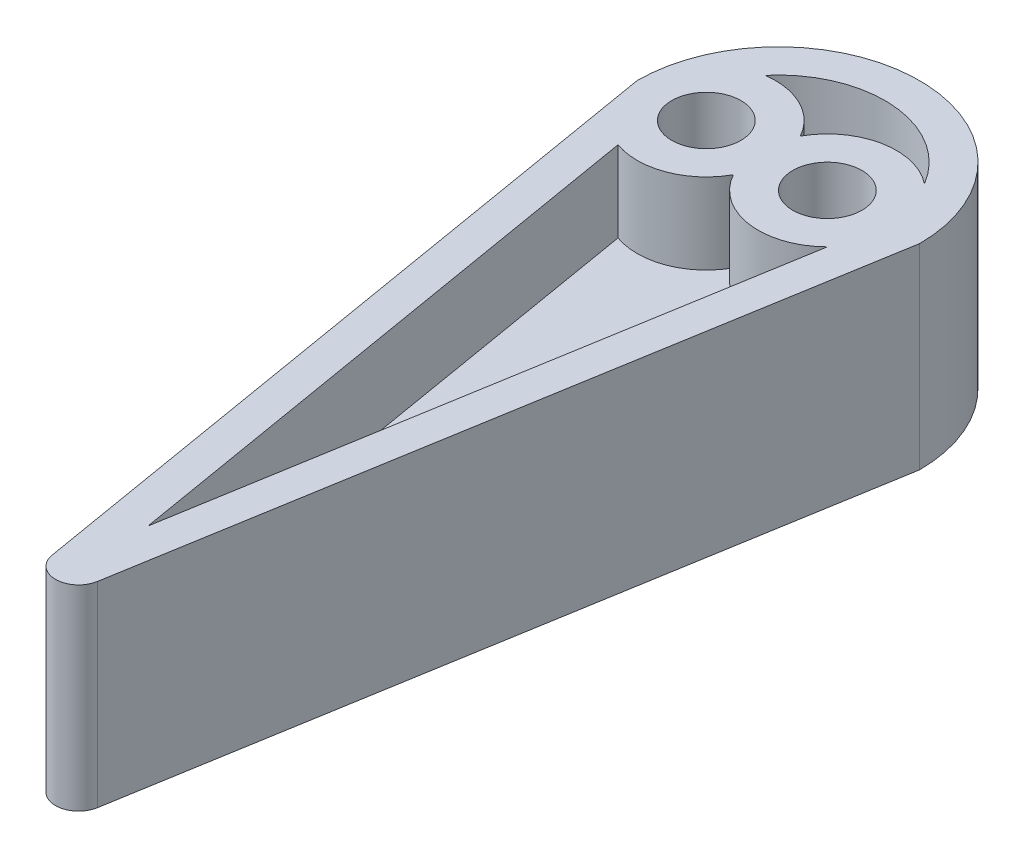
ISO-10303-21;
HEADER;
FILE_DESCRIPTION(('STEP AP214'),'2;1');
FILE_NAME('part.step','',(''),(''),'','','');
FILE_SCHEMA(('AUTOMOTIVE_DESIGN { 1 0 10303 214 1 1 1 1 }'));
ENDSEC;
DATA;
#1=APPLICATION_CONTEXT('core data for automotive mechanical design processes');
#2=APPLICATION_PROTOCOL_DEFINITION('international standard','automotive_design',2000,#1);
#3=PRODUCT_CONTEXT('',#1,'mechanical');
#4=PRODUCT('Part','Part','',(#3));
#5=PRODUCT_RELATED_PRODUCT_CATEGORY('part','',(#4));
#6=PRODUCT_DEFINITION_FORMATION('','',#4);
#7=PRODUCT_DEFINITION_CONTEXT('part definition',#1,'design');
#8=PRODUCT_DEFINITION('design','',#6,#7);
#9=PRODUCT_DEFINITION_SHAPE('','',#8);
#10=(LENGTH_UNIT() NAMED_UNIT(*) SI_UNIT(.MILLI.,.METRE.));
#11=(NAMED_UNIT(*) PLANE_ANGLE_UNIT() SI_UNIT($,.RADIAN.));
#12=(NAMED_UNIT(*) SI_UNIT($,.STERADIAN.) SOLID_ANGLE_UNIT());
#13=UNCERTAINTY_MEASURE_WITH_UNIT(LENGTH_MEASURE(1.E-05),#10,'distance_accuracy_value','');
#14=(GEOMETRIC_REPRESENTATION_CONTEXT(3) GLOBAL_UNCERTAINTY_ASSIGNED_CONTEXT((#13)) GLOBAL_UNIT_ASSIGNED_CONTEXT((#10,
#11,#12)) REPRESENTATION_CONTEXT('',''));
#15=CARTESIAN_POINT('',(0.,0.,0.));
#16=DIRECTION('',(0.,0.,1.));
#17=DIRECTION('',(1.,0.,0.));
#18=AXIS2_PLACEMENT_3D('',#15,#16,#17);
#19=CARTESIAN_POINT('',(0.,8.5,0.));
#20=DIRECTION('',(0.,-1.,0.));
#21=DIRECTION('',(0.,0.,-1.));
#22=AXIS2_PLACEMENT_3D('',#19,#20,#21);
#23=CYLINDRICAL_SURFACE('',#22,12.25);
#24=DIRECTION('',(0.,-1.,0.));
#25=VECTOR('',#24,1.);
#26=CARTESIAN_POINT('',(12.25,8.5,0.));
#27=LINE('',#26,#25);
#28=CARTESIAN_POINT('',(12.25,8.5,0.));
#29=VERTEX_POINT('',#28);
#30=CARTESIAN_POINT('',(12.25,-8.5,0.));
#31=VERTEX_POINT('',#30);
#32=EDGE_CURVE('E294',#29,#31,#27,.T.);
#33=ORIENTED_EDGE('',*,*,#32,.T.);
#34=CARTESIAN_POINT('',(0.,-8.5,0.));
#35=DIRECTION('',(0.,-1.,0.));
#36=DIRECTION('',(0.,0.,-1.));
#37=AXIS2_PLACEMENT_3D('',#34,#35,#36);
#38=CIRCLE('',#37,12.25);
#39=CARTESIAN_POINT('',(-12.25,-8.5,0.));
#40=VERTEX_POINT('',#39);
#41=EDGE_CURVE('E223',#40,#31,#38,.T.);
#42=ORIENTED_EDGE('',*,*,#41,.F.);
#43=DIRECTION('',(0.,-1.,0.));
#44=VECTOR('',#43,1.);
#45=CARTESIAN_POINT('',(-12.25,8.5,0.));
#46=LINE('',#45,#44);
#47=CARTESIAN_POINT('',(-12.25,8.5,0.));
#48=VERTEX_POINT('',#47);
#49=EDGE_CURVE('E295',#48,#40,#46,.T.);
#50=ORIENTED_EDGE('',*,*,#49,.F.);
#51=CARTESIAN_POINT('',(0.,8.5,0.));
#52=DIRECTION('',(0.,-1.,0.));
#53=DIRECTION('',(0.,0.,-1.));
#54=AXIS2_PLACEMENT_3D('',#51,#52,#53);
#55=CIRCLE('',#54,12.25);
#56=EDGE_CURVE('E285',#48,#29,#55,.T.);
#57=ORIENTED_EDGE('',*,*,#56,.T.);
#58=EDGE_LOOP('',(#33,#42,#50,#57));
#59=FACE_BOUND('',#58,.T.);
#60=ADVANCED_FACE('F35',(#59),#23,.T.);
#61=CARTESIAN_POINT('',(-12.25,8.5,0.));
#62=DIRECTION('',(0.986117785045644,0.,-0.166047324629679));
#63=DIRECTION('',(-0.166047324629679,0.,-0.986117785045644));
#64=AXIS2_PLACEMENT_3D('',#61,#62,#63);
#65=PLANE('',#64);
#66=ORIENTED_EDGE('',*,*,#49,.T.);
#67=DIRECTION('',(0.166047324629679,0.,0.986117785045644));
#68=VECTOR('',#67,1.);
#69=CARTESIAN_POINT('',(-12.25,-8.5,0.));
#70=LINE('',#69,#68);
#71=CARTESIAN_POINT('',(-1.97223557009129,-8.5,61.0373356959885));
#72=VERTEX_POINT('',#71);
#73=EDGE_CURVE('E229',#40,#72,#70,.T.);
#74=ORIENTED_EDGE('',*,*,#73,.T.);
#75=DIRECTION('',(0.,-1.,0.));
#76=VECTOR('',#75,1.);
#77=CARTESIAN_POINT('',(-1.97223557009129,8.5,61.0373356959885));
#78=LINE('',#77,#76);
#79=CARTESIAN_POINT('',(-1.97223557009129,8.5,61.0373356959885));
#80=VERTEX_POINT('',#79);
#81=EDGE_CURVE('E43',#72,#80,#78,.F.);
#82=ORIENTED_EDGE('',*,*,#81,.T.);
#83=DIRECTION('',(0.166047324629679,0.,0.986117785045644));
#84=VECTOR('',#83,1.);
#85=CARTESIAN_POINT('',(-12.25,8.5,0.));
#86=LINE('',#85,#84);
#87=EDGE_CURVE('E291',#48,#80,#86,.T.);
#88=ORIENTED_EDGE('',*,*,#87,.F.);
#89=EDGE_LOOP('',(#66,#74,#82,#88));
#90=FACE_BOUND('',#89,.T.);
#91=ADVANCED_FACE('F301',(#90),#65,.F.);
#92=CARTESIAN_POINT('',(12.25,8.5,0.));
#93=DIRECTION('',(0.986117785045644,0.,0.166047324629679));
#94=DIRECTION('',(0.166047324629679,0.,-0.986117785045644));
#95=AXIS2_PLACEMENT_3D('',#92,#93,#94);
#96=PLANE('',#95);
#97=DIRECTION('',(-0.166047324629679,0.,0.986117785045644));
#98=VECTOR('',#97,1.);
#99=CARTESIAN_POINT('',(12.25,8.5,0.));
#100=LINE('',#99,#98);
#101=CARTESIAN_POINT('',(1.97223557009129,8.5,61.0373356959885));
#102=VERTEX_POINT('',#101);
#103=EDGE_CURVE('E288',#29,#102,#100,.T.);
#104=ORIENTED_EDGE('',*,*,#103,.T.);
#105=DIRECTION('',(0.,-1.,0.));
#106=VECTOR('',#105,1.);
#107=CARTESIAN_POINT('',(1.97223557009129,0.,61.0373356959885));
#108=LINE('',#107,#106);
#109=CARTESIAN_POINT('',(1.97223557009129,-8.5,61.0373356959885));
#110=VERTEX_POINT('',#109);
#111=EDGE_CURVE('E297',#102,#110,#108,.T.);
#112=ORIENTED_EDGE('',*,*,#111,.T.);
#113=DIRECTION('',(-0.166047324629679,0.,0.986117785045644));
#114=VECTOR('',#113,1.);
#115=CARTESIAN_POINT('',(12.25,-8.5,0.));
#116=LINE('',#115,#114);
#117=EDGE_CURVE('E226',#31,#110,#116,.T.);
#118=ORIENTED_EDGE('',*,*,#117,.F.);
#119=ORIENTED_EDGE('',*,*,#32,.F.);
#120=EDGE_LOOP('',(#104,#112,#118,#119));
#121=FACE_BOUND('',#120,.T.);
#122=ADVANCED_FACE('F313',(#121),#96,.T.);
#123=CARTESIAN_POINT('',(0.,8.5,0.));
#124=DIRECTION('',(0.,-1.,0.));
#125=DIRECTION('',(0.,0.,-1.));
#126=AXIS2_PLACEMENT_3D('',#123,#124,#125);
#127=PLANE('',#126);
#128=CARTESIAN_POINT('',(4.25,8.5,0.));
#129=DIRECTION('',(0.,-1.,0.));
#130=DIRECTION('',(0.,0.,-1.));
#131=AXIS2_PLACEMENT_3D('',#128,#129,#130);
#132=CIRCLE('',#131,6.);
#133=CARTESIAN_POINT('',(-0.999999999999999,8.5,2.90473750965557));
#134=VERTEX_POINT('',#133);
#135=CARTESIAN_POINT('',(8.49351834088833,8.5,4.24176285175684));
#136=VERTEX_POINT('',#135);
#137=EDGE_CURVE('E267',#134,#136,#132,.F.);
#138=ORIENTED_EDGE('',*,*,#137,.T.);
#139=DIRECTION('',(-0.166047324629679,0.,0.986117785045644));
#140=VECTOR('',#139,1.);
#141=CARTESIAN_POINT('',(8.95389314815881,8.5,1.50770022082399));
#142=LINE('',#141,#140);
#143=CARTESIAN_POINT('',(0.,8.5,54.6828615700937));
#144=VERTEX_POINT('',#143);
#145=EDGE_CURVE('E260',#136,#144,#142,.T.);
#146=ORIENTED_EDGE('',*,*,#145,.T.);
#147=DIRECTION('',(0.166047324629679,0.,0.986117785045644));
#148=VECTOR('',#147,1.);
#149=CARTESIAN_POINT('',(-8.95389314815881,8.5,1.50770022082399));
#150=LINE('',#149,#148);
#151=CARTESIAN_POINT('',(-8.2555704943141,8.5,5.65488169569769));
#152=VERTEX_POINT('',#151);
#153=EDGE_CURVE('E248',#152,#144,#150,.T.);
#154=ORIENTED_EDGE('',*,*,#153,.F.);
#155=CARTESIAN_POINT('',(-6.25,8.5,0.));
#156=DIRECTION('',(0.,-1.,0.));
#157=DIRECTION('',(0.,0.,-1.));
#158=AXIS2_PLACEMENT_3D('',#155,#156,#157);
#159=CIRCLE('',#158,6.);
#160=EDGE_CURVE('E50',#152,#134,#159,.F.);
#161=ORIENTED_EDGE('',*,*,#160,.T.);
#162=EDGE_LOOP('',(#138,#146,#154,#161));
#163=FACE_BOUND('',#162,.T.);
#164=CARTESIAN_POINT('',(7.95588235294118,8.5,-4.71873245545445));
#165=VERTEX_POINT('',#164);
#166=CARTESIAN_POINT('',(-1.,8.5,-2.90473750965556));
#167=VERTEX_POINT('',#166);
#168=EDGE_CURVE('E58',#165,#167,#132,.F.);
#169=ORIENTED_EDGE('',*,*,#168,.T.);
#170=CARTESIAN_POINT('',(-7.09,8.5,-5.94090902135355));
#171=VERTEX_POINT('',#170);
#172=EDGE_CURVE('E257',#167,#171,#159,.F.);
#173=ORIENTED_EDGE('',*,*,#172,.T.);
#174=CARTESIAN_POINT('',(0.,8.5,0.));
#175=DIRECTION('',(0.,-1.,0.));
#176=DIRECTION('',(0.,0.,-1.));
#177=AXIS2_PLACEMENT_3D('',#174,#175,#176);
#178=CIRCLE('',#177,9.25);
#179=EDGE_CURVE('E243',#171,#165,#178,.T.);
#180=ORIENTED_EDGE('',*,*,#179,.T.);
#181=EDGE_LOOP('',(#169,#173,#180));
#182=FACE_BOUND('',#181,.T.);
#183=CARTESIAN_POINT('',(4.25,8.5,0.));
#184=DIRECTION('',(0.,1.,0.));
#185=DIRECTION('',(0.,0.,1.));
#186=AXIS2_PLACEMENT_3D('',#183,#184,#185);
#187=CIRCLE('',#186,3.);
#188=CARTESIAN_POINT('',(4.25,8.5,3.));
#189=VERTEX_POINT('',#188);
#190=EDGE_CURVE('E279',#189,#189,#187,.T.);
#191=ORIENTED_EDGE('',*,*,#190,.F.);
#192=EDGE_LOOP('',(#191));
#193=FACE_BOUND('',#192,.T.);
#194=CARTESIAN_POINT('',(-6.25,8.5,0.));
#195=DIRECTION('',(0.,1.,0.));
#196=DIRECTION('',(0.,0.,1.));
#197=AXIS2_PLACEMENT_3D('',#194,#195,#196);
#198=CIRCLE('',#197,3.);
#199=CARTESIAN_POINT('',(-6.25,8.5,3.00000000000001));
#200=VERTEX_POINT('',#199);
#201=EDGE_CURVE('E282',#200,#200,#198,.T.);
#202=ORIENTED_EDGE('',*,*,#201,.F.);
#203=EDGE_LOOP('',(#202));
#204=FACE_BOUND('',#203,.T.);
#205=ORIENTED_EDGE('',*,*,#87,.T.);
#206=CARTESIAN_POINT('',(0.,8.5,60.7052410467291));
#207=DIRECTION('',(0.,-1.,0.));
#208=DIRECTION('',(0.,0.,-1.));
#209=AXIS2_PLACEMENT_3D('',#206,#207,#208);
#210=CIRCLE('',#209,2.);
#211=EDGE_CURVE('E11',#80,#102,#210,.F.);
#212=ORIENTED_EDGE('',*,*,#211,.T.);
#213=ORIENTED_EDGE('',*,*,#103,.F.);
#214=ORIENTED_EDGE('',*,*,#56,.F.);
#215=EDGE_LOOP('',(#205,#212,#213,#214));
#216=FACE_BOUND('',#215,.T.);
#217=ADVANCED_FACE('F308',(#163,#182,#193,#204,#216),#127,.F.);
#218=CARTESIAN_POINT('',(0.,8.5,60.7052410467291));
#219=DIRECTION('',(0.,1.,0.));
#220=DIRECTION('',(0.,0.,1.));
#221=AXIS2_PLACEMENT_3D('',#218,#219,#220);
#222=CYLINDRICAL_SURFACE('',#221,2.);
#223=ORIENTED_EDGE('',*,*,#211,.F.);
#224=ORIENTED_EDGE('',*,*,#81,.F.);
#225=CARTESIAN_POINT('',(0.,-8.5,60.7052410467291));
#226=DIRECTION('',(0.,-1.,0.));
#227=DIRECTION('',(0.,0.,-1.));
#228=AXIS2_PLACEMENT_3D('',#225,#226,#227);
#229=CIRCLE('',#228,2.);
#230=EDGE_CURVE('E232',#72,#110,#229,.F.);
#231=ORIENTED_EDGE('',*,*,#230,.T.);
#232=ORIENTED_EDGE('',*,*,#111,.F.);
#233=EDGE_LOOP('',(#223,#224,#231,#232));
#234=FACE_BOUND('',#233,.T.);
#235=ADVANCED_FACE('F37',(#234),#222,.T.);
#236=CARTESIAN_POINT('',(-6.25,0.,0.));
#237=DIRECTION('',(0.,1.,0.));
#238=DIRECTION('',(0.,0.,1.));
#239=AXIS2_PLACEMENT_3D('',#236,#237,#238);
#240=CYLINDRICAL_SURFACE('',#239,3.);
#241=ORIENTED_EDGE('',*,*,#201,.T.);
#242=EDGE_LOOP('',(#241));
#243=FACE_BOUND('',#242,.T.);
#244=CARTESIAN_POINT('',(-6.25,-8.5,0.));
#245=DIRECTION('',(0.,1.,0.));
#246=DIRECTION('',(0.,0.,1.));
#247=AXIS2_PLACEMENT_3D('',#244,#245,#246);
#248=CIRCLE('',#247,3.);
#249=CARTESIAN_POINT('',(-6.25,-8.5,3.00000000000001));
#250=VERTEX_POINT('',#249);
#251=EDGE_CURVE('E220',#250,#250,#248,.T.);
#252=ORIENTED_EDGE('',*,*,#251,.F.);
#253=EDGE_LOOP('',(#252));
#254=FACE_BOUND('',#253,.T.);
#255=ADVANCED_FACE('F349',(#243,#254),#240,.F.);
#256=CARTESIAN_POINT('',(4.25,0.,0.));
#257=DIRECTION('',(0.,1.,0.));
#258=DIRECTION('',(0.,0.,1.));
#259=AXIS2_PLACEMENT_3D('',#256,#257,#258);
#260=CYLINDRICAL_SURFACE('',#259,3.);
#261=ORIENTED_EDGE('',*,*,#190,.T.);
#262=EDGE_LOOP('',(#261));
#263=FACE_BOUND('',#262,.T.);
#264=CARTESIAN_POINT('',(4.25,-8.5,0.));
#265=DIRECTION('',(0.,1.,0.));
#266=DIRECTION('',(0.,0.,1.));
#267=AXIS2_PLACEMENT_3D('',#264,#265,#266);
#268=CIRCLE('',#267,3.);
#269=CARTESIAN_POINT('',(4.25,-8.5,3.));
#270=VERTEX_POINT('',#269);
#271=EDGE_CURVE('E217',#270,#270,#268,.T.);
#272=ORIENTED_EDGE('',*,*,#271,.F.);
#273=EDGE_LOOP('',(#272));
#274=FACE_BOUND('',#273,.T.);
#275=ADVANCED_FACE('F352',(#263,#274),#260,.F.);
#276=CARTESIAN_POINT('',(0.,8.5,0.));
#277=DIRECTION('',(0.,-1.,0.));
#278=DIRECTION('',(0.,0.,-1.));
#279=AXIS2_PLACEMENT_3D('',#276,#277,#278);
#280=CYLINDRICAL_SURFACE('',#279,9.25);
#281=CARTESIAN_POINT('',(0.,1.5,0.));
#282=DIRECTION('',(0.,-1.,0.));
#283=DIRECTION('',(0.,0.,-1.));
#284=AXIS2_PLACEMENT_3D('',#281,#282,#283);
#285=CIRCLE('',#284,9.25);
#286=CARTESIAN_POINT('',(-7.09,1.5,-5.94090902135355));
#287=VERTEX_POINT('',#286);
#288=CARTESIAN_POINT('',(7.95588235294118,1.5,-4.71873245545445));
#289=VERTEX_POINT('',#288);
#290=EDGE_CURVE('E235',#287,#289,#285,.T.);
#291=ORIENTED_EDGE('',*,*,#290,.T.);
#292=DIRECTION('',(0.,1.,0.));
#293=VECTOR('',#292,1.);
#294=CARTESIAN_POINT('',(7.95588235294118,0.,-4.71873245545445));
#295=LINE('',#294,#293);
#296=EDGE_CURVE('E273',#289,#165,#295,.T.);
#297=ORIENTED_EDGE('',*,*,#296,.T.);
#298=ORIENTED_EDGE('',*,*,#179,.F.);
#299=DIRECTION('',(0.,1.,0.));
#300=VECTOR('',#299,1.);
#301=CARTESIAN_POINT('',(-7.09,8.5,-5.94090902135355));
#302=LINE('',#301,#300);
#303=EDGE_CURVE('E277',#287,#171,#302,.T.);
#304=ORIENTED_EDGE('',*,*,#303,.F.);
#305=EDGE_LOOP('',(#291,#297,#298,#304));
#306=FACE_BOUND('',#305,.T.);
#307=ADVANCED_FACE('F355',(#306),#280,.F.);
#308=CARTESIAN_POINT('',(0.,1.5,0.));
#309=DIRECTION('',(0.,-1.,0.));
#310=DIRECTION('',(0.,0.,-1.));
#311=AXIS2_PLACEMENT_3D('',#308,#309,#310);
#312=PLANE('',#311);
#313=CARTESIAN_POINT('',(4.25,1.5,0.));
#314=DIRECTION('',(0.,-1.,0.));
#315=DIRECTION('',(0.,0.,-1.));
#316=AXIS2_PLACEMENT_3D('',#313,#314,#315);
#317=CIRCLE('',#316,6.);
#318=CARTESIAN_POINT('',(-1.,1.5,-2.90473750965556));
#319=VERTEX_POINT('',#318);
#320=EDGE_CURVE('E250',#289,#319,#317,.F.);
#321=ORIENTED_EDGE('',*,*,#320,.F.);
#322=ORIENTED_EDGE('',*,*,#290,.F.);
#323=CARTESIAN_POINT('',(-6.25,1.5,0.));
#324=DIRECTION('',(0.,-1.,0.));
#325=DIRECTION('',(0.,0.,-1.));
#326=AXIS2_PLACEMENT_3D('',#323,#324,#325);
#327=CIRCLE('',#326,6.);
#328=EDGE_CURVE('E254',#319,#287,#327,.F.);
#329=ORIENTED_EDGE('',*,*,#328,.F.);
#330=EDGE_LOOP('',(#321,#322,#329));
#331=FACE_BOUND('',#330,.T.);
#332=ADVANCED_FACE('F366',(#331),#312,.F.);
#333=CARTESIAN_POINT('',(4.25,0.,0.));
#334=DIRECTION('',(0.,1.,0.));
#335=DIRECTION('',(0.,0.,1.));
#336=AXIS2_PLACEMENT_3D('',#333,#334,#335);
#337=CYLINDRICAL_SURFACE('',#336,6.);
#338=ORIENTED_EDGE('',*,*,#320,.T.);
#339=DIRECTION('',(0.,-1.,0.));
#340=VECTOR('',#339,1.);
#341=CARTESIAN_POINT('',(-1.,0.,-2.90473750965556));
#342=LINE('',#341,#340);
#343=EDGE_CURVE('E247',#167,#319,#342,.T.);
#344=ORIENTED_EDGE('',*,*,#343,.F.);
#345=ORIENTED_EDGE('',*,*,#168,.F.);
#346=ORIENTED_EDGE('',*,*,#296,.F.);
#347=EDGE_LOOP('',(#338,#344,#345,#346));
#348=FACE_BOUND('',#347,.T.);
#349=ADVANCED_FACE('F333',(#348),#337,.T.);
#350=CARTESIAN_POINT('',(-6.25,0.,0.));
#351=DIRECTION('',(0.,1.,0.));
#352=DIRECTION('',(0.,0.,1.));
#353=AXIS2_PLACEMENT_3D('',#350,#351,#352);
#354=CYLINDRICAL_SURFACE('',#353,6.);
#355=ORIENTED_EDGE('',*,*,#303,.T.);
#356=ORIENTED_EDGE('',*,*,#172,.F.);
#357=ORIENTED_EDGE('',*,*,#343,.T.);
#358=ORIENTED_EDGE('',*,*,#328,.T.);
#359=EDGE_LOOP('',(#355,#356,#357,#358));
#360=FACE_BOUND('',#359,.T.);
#361=ADVANCED_FACE('F361',(#360),#354,.T.);
#362=CARTESIAN_POINT('',(-9.29164664486307,8.5,-0.498141973889034));
#363=DIRECTION('',(0.986117785045644,0.,-0.166047324629679));
#364=DIRECTION('',(-0.166047324629679,0.,-0.986117785045644));
#365=AXIS2_PLACEMENT_3D('',#362,#363,#364);
#366=PLANE('',#365);
#367=ORIENTED_EDGE('',*,*,#153,.T.);
#368=DIRECTION('',(0.,1.,0.));
#369=VECTOR('',#368,1.);
#370=CARTESIAN_POINT('',(0.,8.5,54.6828615700937));
#371=LINE('',#370,#369);
#372=CARTESIAN_POINT('',(0.,1.5,54.6828615700937));
#373=VERTEX_POINT('',#372);
#374=EDGE_CURVE('E244',#373,#144,#371,.T.);
#375=ORIENTED_EDGE('',*,*,#374,.F.);
#376=DIRECTION('',(0.166047324629679,0.,0.986117785045644));
#377=VECTOR('',#376,1.);
#378=CARTESIAN_POINT('',(-8.95389314815881,1.5,1.50770022082399));
#379=LINE('',#378,#377);
#380=CARTESIAN_POINT('',(-8.2555704943141,1.5,5.65488169569769));
#381=VERTEX_POINT('',#380);
#382=EDGE_CURVE('E240',#381,#373,#379,.T.);
#383=ORIENTED_EDGE('',*,*,#382,.F.);
#384=DIRECTION('',(0.,1.,0.));
#385=VECTOR('',#384,1.);
#386=CARTESIAN_POINT('',(-8.2555704943141,0.,5.65488169569769));
#387=LINE('',#386,#385);
#388=EDGE_CURVE('E275',#152,#381,#387,.F.);
#389=ORIENTED_EDGE('',*,*,#388,.F.);
#390=EDGE_LOOP('',(#367,#375,#383,#389));
#391=FACE_BOUND('',#390,.T.);
#392=ADVANCED_FACE('F369',(#391),#366,.T.);
#393=CARTESIAN_POINT('',(9.29164664486307,8.5,-0.498141973889035));
#394=DIRECTION('',(0.986117785045644,0.,0.166047324629679));
#395=DIRECTION('',(0.166047324629679,0.,-0.986117785045644));
#396=AXIS2_PLACEMENT_3D('',#393,#394,#395);
#397=PLANE('',#396);
#398=DIRECTION('',(-0.166047324629679,0.,0.986117785045644));
#399=VECTOR('',#398,1.);
#400=CARTESIAN_POINT('',(8.95389314815881,1.5,1.50770022082399));
#401=LINE('',#400,#399);
#402=CARTESIAN_POINT('',(8.49351834088833,1.5,4.24176285175684));
#403=VERTEX_POINT('',#402);
#404=EDGE_CURVE('E238',#403,#373,#401,.T.);
#405=ORIENTED_EDGE('',*,*,#404,.T.);
#406=ORIENTED_EDGE('',*,*,#374,.T.);
#407=ORIENTED_EDGE('',*,*,#145,.F.);
#408=DIRECTION('',(0.,1.,0.));
#409=VECTOR('',#408,1.);
#410=CARTESIAN_POINT('',(8.49351834088833,0.,4.24176285175684));
#411=LINE('',#410,#409);
#412=EDGE_CURVE('E271',#403,#136,#411,.T.);
#413=ORIENTED_EDGE('',*,*,#412,.F.);
#414=EDGE_LOOP('',(#405,#406,#407,#413));
#415=FACE_BOUND('',#414,.T.);
#416=ADVANCED_FACE('F364',(#415),#397,.F.);
#417=ORIENTED_EDGE('',*,*,#382,.T.);
#418=ORIENTED_EDGE('',*,*,#404,.F.);
#419=CARTESIAN_POINT('',(-0.999999999999999,1.5,2.90473750965557));
#420=VERTEX_POINT('',#419);
#421=EDGE_CURVE('E253',#420,#403,#317,.F.);
#422=ORIENTED_EDGE('',*,*,#421,.F.);
#423=EDGE_CURVE('E239',#381,#420,#327,.F.);
#424=ORIENTED_EDGE('',*,*,#423,.F.);
#425=EDGE_LOOP('',(#417,#418,#422,#424));
#426=FACE_BOUND('',#425,.T.);
#427=ADVANCED_FACE('F360',(#426),#312,.F.);
#428=ORIENTED_EDGE('',*,*,#388,.T.);
#429=ORIENTED_EDGE('',*,*,#423,.T.);
#430=DIRECTION('',(0.,-1.,0.));
#431=VECTOR('',#430,1.);
#432=CARTESIAN_POINT('',(-0.999999999999999,0.,2.90473750965557));
#433=LINE('',#432,#431);
#434=EDGE_CURVE('E269',#134,#420,#433,.T.);
#435=ORIENTED_EDGE('',*,*,#434,.F.);
#436=ORIENTED_EDGE('',*,*,#160,.F.);
#437=EDGE_LOOP('',(#428,#429,#435,#436));
#438=FACE_BOUND('',#437,.T.);
#439=ADVANCED_FACE('F330',(#438),#354,.T.);
#440=ORIENTED_EDGE('',*,*,#412,.T.);
#441=ORIENTED_EDGE('',*,*,#137,.F.);
#442=ORIENTED_EDGE('',*,*,#434,.T.);
#443=ORIENTED_EDGE('',*,*,#421,.T.);
#444=EDGE_LOOP('',(#440,#441,#442,#443));
#445=FACE_BOUND('',#444,.T.);
#446=ADVANCED_FACE('F320',(#445),#337,.T.);
#447=CARTESIAN_POINT('',(0.,-8.5,0.));
#448=DIRECTION('',(0.,1.,0.));
#449=DIRECTION('',(0.,0.,-1.));
#450=AXIS2_PLACEMENT_3D('',#447,#448,#449);
#451=PLANE('',#450);
#452=CARTESIAN_POINT('',(4.25,-8.5,0.));
#453=DIRECTION('',(0.,-1.,0.));
#454=DIRECTION('',(0.,0.,-1.));
#455=AXIS2_PLACEMENT_3D('',#452,#453,#454);
#456=CIRCLE('',#455,6.);
#457=CARTESIAN_POINT('',(-0.999999999999999,-8.5,2.90473750965557));
#458=VERTEX_POINT('',#457);
#459=CARTESIAN_POINT('',(8.49351834088833,-8.5,4.24176285175684));
#460=VERTEX_POINT('',#459);
#461=EDGE_CURVE('E206',#458,#460,#456,.F.);
#462=ORIENTED_EDGE('',*,*,#461,.F.);
#463=CARTESIAN_POINT('',(-6.25,-8.5,0.));
#464=DIRECTION('',(0.,-1.,0.));
#465=DIRECTION('',(0.,0.,-1.));
#466=AXIS2_PLACEMENT_3D('',#463,#464,#465);
#467=CIRCLE('',#466,6.);
#468=CARTESIAN_POINT('',(-8.2555704943141,-8.5,5.65488169569769));
#469=VERTEX_POINT('',#468);
#470=EDGE_CURVE('E194',#469,#458,#467,.F.);
#471=ORIENTED_EDGE('',*,*,#470,.F.);
#472=DIRECTION('',(0.166047324629679,0.,0.986117785045644));
#473=VECTOR('',#472,1.);
#474=CARTESIAN_POINT('',(-8.95389314815881,-8.5,1.50770022082399));
#475=LINE('',#474,#473);
#476=CARTESIAN_POINT('',(0.,-8.5,54.6828615700937));
#477=VERTEX_POINT('',#476);
#478=EDGE_CURVE('E181',#469,#477,#475,.T.);
#479=ORIENTED_EDGE('',*,*,#478,.T.);
#480=DIRECTION('',(-0.166047324629679,0.,0.986117785045644));
#481=VECTOR('',#480,1.);
#482=CARTESIAN_POINT('',(8.95389314815881,-8.5,1.50770022082399));
#483=LINE('',#482,#481);
#484=EDGE_CURVE('E176',#460,#477,#483,.T.);
#485=ORIENTED_EDGE('',*,*,#484,.F.);
#486=EDGE_LOOP('',(#462,#471,#479,#485));
#487=FACE_BOUND('',#486,.T.);
#488=CARTESIAN_POINT('',(7.95588235294118,-8.5,-4.71873245545445));
#489=VERTEX_POINT('',#488);
#490=CARTESIAN_POINT('',(-1.,-8.5,-2.90473750965556));
#491=VERTEX_POINT('',#490);
#492=EDGE_CURVE('E203',#489,#491,#456,.F.);
#493=ORIENTED_EDGE('',*,*,#492,.F.);
#494=CARTESIAN_POINT('',(0.,-8.5,0.));
#495=DIRECTION('',(0.,-1.,0.));
#496=DIRECTION('',(0.,0.,-1.));
#497=AXIS2_PLACEMENT_3D('',#494,#495,#496);
#498=CIRCLE('',#497,9.25);
#499=CARTESIAN_POINT('',(-7.09,-8.5,-5.94090902135355));
#500=VERTEX_POINT('',#499);
#501=EDGE_CURVE('E185',#500,#489,#498,.T.);
#502=ORIENTED_EDGE('',*,*,#501,.F.);
#503=EDGE_CURVE('E197',#491,#500,#467,.F.);
#504=ORIENTED_EDGE('',*,*,#503,.F.);
#505=EDGE_LOOP('',(#493,#502,#504));
#506=FACE_BOUND('',#505,.T.);
#507=ORIENTED_EDGE('',*,*,#271,.T.);
#508=EDGE_LOOP('',(#507));
#509=FACE_BOUND('',#508,.T.);
#510=ORIENTED_EDGE('',*,*,#251,.T.);
#511=EDGE_LOOP('',(#510));
#512=FACE_BOUND('',#511,.T.);
#513=ORIENTED_EDGE('',*,*,#73,.F.);
#514=ORIENTED_EDGE('',*,*,#41,.T.);
#515=ORIENTED_EDGE('',*,*,#117,.T.);
#516=ORIENTED_EDGE('',*,*,#230,.F.);
#517=EDGE_LOOP('',(#513,#514,#515,#516));
#518=FACE_BOUND('',#517,.T.);
#519=ADVANCED_FACE('F317',(#487,#506,#509,#512,#518),#451,.F.);
#520=CARTESIAN_POINT('',(0.,-8.5,0.));
#521=DIRECTION('',(0.,1.,0.));
#522=DIRECTION('',(0.,0.,-1.));
#523=AXIS2_PLACEMENT_3D('',#520,#521,#522);
#524=CYLINDRICAL_SURFACE('',#523,9.25);
#525=CARTESIAN_POINT('',(0.,-1.5,0.));
#526=DIRECTION('',(0.,-1.,0.));
#527=DIRECTION('',(0.,0.,-1.));
#528=AXIS2_PLACEMENT_3D('',#525,#526,#527);
#529=CIRCLE('',#528,9.25);
#530=CARTESIAN_POINT('',(-7.09,-1.5,-5.94090902135355));
#531=VERTEX_POINT('',#530);
#532=CARTESIAN_POINT('',(7.95588235294118,-1.5,-4.71873245545445));
#533=VERTEX_POINT('',#532);
#534=EDGE_CURVE('E170',#531,#533,#529,.T.);
#535=ORIENTED_EDGE('',*,*,#534,.F.);
#536=DIRECTION('',(0.,-1.,0.));
#537=VECTOR('',#536,1.);
#538=CARTESIAN_POINT('',(-7.09,-8.5,-5.94090902135355));
#539=LINE('',#538,#537);
#540=EDGE_CURVE('E215',#531,#500,#539,.T.);
#541=ORIENTED_EDGE('',*,*,#540,.T.);
#542=ORIENTED_EDGE('',*,*,#501,.T.);
#543=DIRECTION('',(0.,-1.,0.));
#544=VECTOR('',#543,1.);
#545=CARTESIAN_POINT('',(7.95588235294118,0.,-4.71873245545445));
#546=LINE('',#545,#544);
#547=EDGE_CURVE('E212',#533,#489,#546,.T.);
#548=ORIENTED_EDGE('',*,*,#547,.F.);
#549=EDGE_LOOP('',(#535,#541,#542,#548));
#550=FACE_BOUND('',#549,.T.);
#551=ADVANCED_FACE('F319',(#550),#524,.F.);
#552=CARTESIAN_POINT('',(0.,-1.5,0.));
#553=DIRECTION('',(0.,1.,0.));
#554=DIRECTION('',(0.,0.,-1.));
#555=AXIS2_PLACEMENT_3D('',#552,#553,#554);
#556=PLANE('',#555);
#557=CARTESIAN_POINT('',(4.25,-1.5,0.));
#558=DIRECTION('',(0.,-1.,0.));
#559=DIRECTION('',(0.,0.,-1.));
#560=AXIS2_PLACEMENT_3D('',#557,#558,#559);
#561=CIRCLE('',#560,6.);
#562=CARTESIAN_POINT('',(-1.,-1.5,-2.90473750965556));
#563=VERTEX_POINT('',#562);
#564=EDGE_CURVE('E191',#533,#563,#561,.F.);
#565=ORIENTED_EDGE('',*,*,#564,.T.);
#566=CARTESIAN_POINT('',(-6.25,-1.5,0.));
#567=DIRECTION('',(0.,-1.,0.));
#568=DIRECTION('',(0.,0.,-1.));
#569=AXIS2_PLACEMENT_3D('',#566,#567,#568);
#570=CIRCLE('',#569,6.);
#571=EDGE_CURVE('E195',#563,#531,#570,.F.);
#572=ORIENTED_EDGE('',*,*,#571,.T.);
#573=ORIENTED_EDGE('',*,*,#534,.T.);
#574=EDGE_LOOP('',(#565,#572,#573));
#575=FACE_BOUND('',#574,.T.);
#576=ADVANCED_FACE('F327',(#575),#556,.F.);
#577=CARTESIAN_POINT('',(4.25,0.,0.));
#578=DIRECTION('',(0.,-1.,0.));
#579=DIRECTION('',(0.,0.,1.));
#580=AXIS2_PLACEMENT_3D('',#577,#578,#579);
#581=CYLINDRICAL_SURFACE('',#580,6.);
#582=ORIENTED_EDGE('',*,*,#564,.F.);
#583=ORIENTED_EDGE('',*,*,#547,.T.);
#584=ORIENTED_EDGE('',*,*,#492,.T.);
#585=DIRECTION('',(0.,1.,0.));
#586=VECTOR('',#585,1.);
#587=CARTESIAN_POINT('',(-1.,0.,-2.90473750965556));
#588=LINE('',#587,#586);
#589=EDGE_CURVE('E180',#491,#563,#588,.T.);
#590=ORIENTED_EDGE('',*,*,#589,.T.);
#591=EDGE_LOOP('',(#582,#583,#584,#590));
#592=FACE_BOUND('',#591,.T.);
#593=ADVANCED_FACE('F521',(#592),#581,.T.);
#594=CARTESIAN_POINT('',(-6.25,0.,0.));
#595=DIRECTION('',(0.,-1.,0.));
#596=DIRECTION('',(0.,0.,1.));
#597=AXIS2_PLACEMENT_3D('',#594,#595,#596);
#598=CYLINDRICAL_SURFACE('',#597,6.);
#599=ORIENTED_EDGE('',*,*,#540,.F.);
#600=ORIENTED_EDGE('',*,*,#571,.F.);
#601=ORIENTED_EDGE('',*,*,#589,.F.);
#602=ORIENTED_EDGE('',*,*,#503,.T.);
#603=EDGE_LOOP('',(#599,#600,#601,#602));
#604=FACE_BOUND('',#603,.T.);
#605=ADVANCED_FACE('F531',(#604),#598,.T.);
#606=CARTESIAN_POINT('',(-9.29164664486307,-8.5,-0.498141973889034));
#607=DIRECTION('',(0.986117785045644,0.,-0.166047324629679));
#608=DIRECTION('',(-0.166047324629679,0.,-0.986117785045644));
#609=AXIS2_PLACEMENT_3D('',#606,#607,#608);
#610=PLANE('',#609);
#611=ORIENTED_EDGE('',*,*,#478,.F.);
#612=DIRECTION('',(0.,-1.,0.));
#613=VECTOR('',#612,1.);
#614=CARTESIAN_POINT('',(-8.2555704943141,0.,5.65488169569769));
#615=LINE('',#614,#613);
#616=CARTESIAN_POINT('',(-8.2555704943141,-1.5,5.65488169569769));
#617=VERTEX_POINT('',#616);
#618=EDGE_CURVE('E184',#469,#617,#615,.F.);
#619=ORIENTED_EDGE('',*,*,#618,.T.);
#620=DIRECTION('',(0.166047324629679,0.,0.986117785045644));
#621=VECTOR('',#620,1.);
#622=CARTESIAN_POINT('',(-8.95389314815881,-1.5,1.50770022082399));
#623=LINE('',#622,#621);
#624=CARTESIAN_POINT('',(0.,-1.5,54.6828615700937));
#625=VERTEX_POINT('',#624);
#626=EDGE_CURVE('E164',#617,#625,#623,.T.);
#627=ORIENTED_EDGE('',*,*,#626,.T.);
#628=DIRECTION('',(0.,-1.,0.));
#629=VECTOR('',#628,1.);
#630=CARTESIAN_POINT('',(0.,-8.5,54.6828615700937));
#631=LINE('',#630,#629);
#632=EDGE_CURVE('E173',#625,#477,#631,.T.);
#633=ORIENTED_EDGE('',*,*,#632,.T.);
#634=EDGE_LOOP('',(#611,#619,#627,#633));
#635=FACE_BOUND('',#634,.T.);
#636=ADVANCED_FACE('F183',(#635),#610,.T.);
#637=CARTESIAN_POINT('',(9.29164664486307,-8.5,-0.498141973889035));
#638=DIRECTION('',(0.986117785045644,0.,0.166047324629679));
#639=DIRECTION('',(0.166047324629679,0.,-0.986117785045644));
#640=AXIS2_PLACEMENT_3D('',#637,#638,#639);
#641=PLANE('',#640);
#642=DIRECTION('',(-0.166047324629679,0.,0.986117785045644));
#643=VECTOR('',#642,1.);
#644=CARTESIAN_POINT('',(8.95389314815881,-1.5,1.50770022082399));
#645=LINE('',#644,#643);
#646=CARTESIAN_POINT('',(8.49351834088833,-1.5,4.24176285175684));
#647=VERTEX_POINT('',#646);
#648=EDGE_CURVE('E159',#647,#625,#645,.T.);
#649=ORIENTED_EDGE('',*,*,#648,.F.);
#650=DIRECTION('',(0.,-1.,0.));
#651=VECTOR('',#650,1.);
#652=CARTESIAN_POINT('',(8.49351834088833,0.,4.24176285175684));
#653=LINE('',#652,#651);
#654=EDGE_CURVE('E210',#647,#460,#653,.T.);
#655=ORIENTED_EDGE('',*,*,#654,.T.);
#656=ORIENTED_EDGE('',*,*,#484,.T.);
#657=ORIENTED_EDGE('',*,*,#632,.F.);
#658=EDGE_LOOP('',(#649,#655,#656,#657));
#659=FACE_BOUND('',#658,.T.);
#660=ADVANCED_FACE('F174',(#659),#641,.F.);
#661=ORIENTED_EDGE('',*,*,#626,.F.);
#662=CARTESIAN_POINT('',(-0.999999999999999,-1.5,2.90473750965557));
#663=VERTEX_POINT('',#662);
#664=EDGE_CURVE('E196',#617,#663,#570,.F.);
#665=ORIENTED_EDGE('',*,*,#664,.T.);
#666=EDGE_CURVE('E167',#663,#647,#561,.F.);
#667=ORIENTED_EDGE('',*,*,#666,.T.);
#668=ORIENTED_EDGE('',*,*,#648,.T.);
#669=EDGE_LOOP('',(#661,#665,#667,#668));
#670=FACE_BOUND('',#669,.T.);
#671=ADVANCED_FACE('F161',(#670),#556,.F.);
#672=ORIENTED_EDGE('',*,*,#618,.F.);
#673=ORIENTED_EDGE('',*,*,#470,.T.);
#674=DIRECTION('',(0.,1.,0.));
#675=VECTOR('',#674,1.);
#676=CARTESIAN_POINT('',(-0.999999999999999,0.,2.90473750965557));
#677=LINE('',#676,#675);
#678=EDGE_CURVE('E208',#458,#663,#677,.T.);
#679=ORIENTED_EDGE('',*,*,#678,.T.);
#680=ORIENTED_EDGE('',*,*,#664,.F.);
#681=EDGE_LOOP('',(#672,#673,#679,#680));
#682=FACE_BOUND('',#681,.T.);
#683=ADVANCED_FACE('F543',(#682),#598,.T.);
#684=ORIENTED_EDGE('',*,*,#654,.F.);
#685=ORIENTED_EDGE('',*,*,#666,.F.);
#686=ORIENTED_EDGE('',*,*,#678,.F.);
#687=ORIENTED_EDGE('',*,*,#461,.T.);
#688=EDGE_LOOP('',(#684,#685,#686,#687));
#689=FACE_BOUND('',#688,.T.);
#690=ADVANCED_FACE('F533',(#689),#581,.T.);
#691=CLOSED_SHELL('',(#60,#91,#122,#217,#235,#255,#275,#307,#332,#349,#361,#392,#416,#427,#439,
#446,#519,#551,#576,#593,#605,#636,#660,#671,#683,#690));
#692=MANIFOLD_SOLID_BREP('B2',#691);
#693=ADVANCED_BREP_SHAPE_REPRESENTATION('',(#18,#692),#14);
#694=SHAPE_DEFINITION_REPRESENTATION(#9,#693);
ENDSEC;
END-ISO-10303-21;
